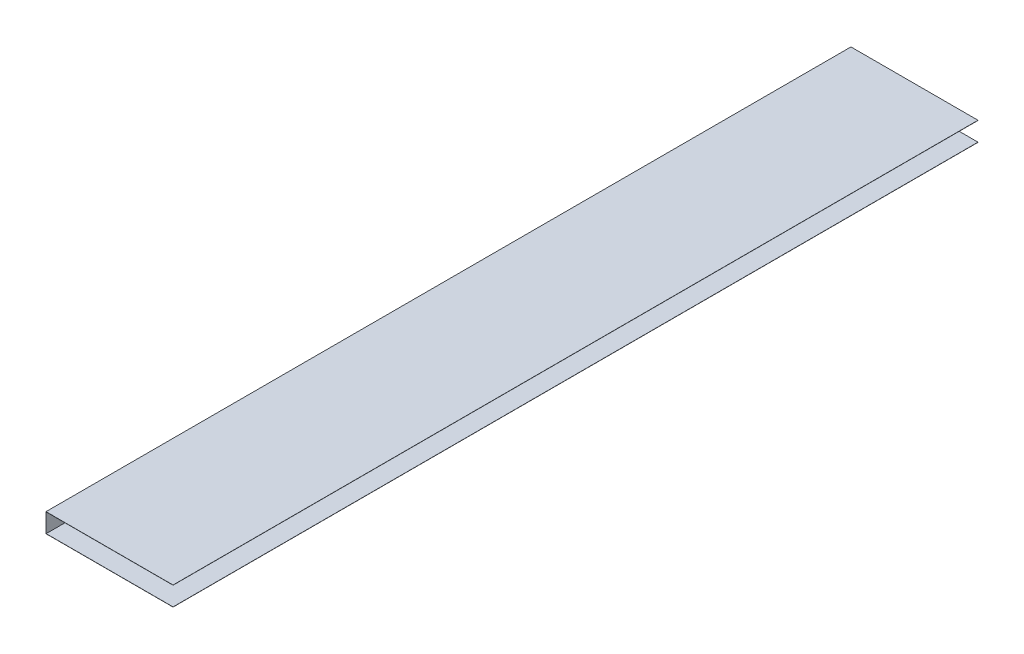
ISO-10303-21;
HEADER;
FILE_DESCRIPTION(('STEP AP214'),'2;1');
FILE_NAME('part.step','',(''),(''),'','','');
FILE_SCHEMA(('AUTOMOTIVE_DESIGN { 1 0 10303 214 1 1 1 1 }'));
ENDSEC;
DATA;
#1=APPLICATION_CONTEXT('core data for automotive mechanical design processes');
#2=APPLICATION_PROTOCOL_DEFINITION('international standard','automotive_design',2000,#1);
#3=PRODUCT_CONTEXT('',#1,'mechanical');
#4=PRODUCT('Part','Part','',(#3));
#5=PRODUCT_RELATED_PRODUCT_CATEGORY('part','',(#4));
#6=PRODUCT_DEFINITION_FORMATION('','',#4);
#7=PRODUCT_DEFINITION_CONTEXT('part definition',#1,'design');
#8=PRODUCT_DEFINITION('design','',#6,#7);
#9=PRODUCT_DEFINITION_SHAPE('','',#8);
#10=(LENGTH_UNIT() NAMED_UNIT(*) SI_UNIT(.MILLI.,.METRE.));
#11=(NAMED_UNIT(*) PLANE_ANGLE_UNIT() SI_UNIT($,.RADIAN.));
#12=(NAMED_UNIT(*) SI_UNIT($,.STERADIAN.) SOLID_ANGLE_UNIT());
#13=UNCERTAINTY_MEASURE_WITH_UNIT(LENGTH_MEASURE(1.E-05),#10,'distance_accuracy_value','');
#14=(GEOMETRIC_REPRESENTATION_CONTEXT(3) GLOBAL_UNCERTAINTY_ASSIGNED_CONTEXT((#13)) GLOBAL_UNIT_ASSIGNED_CONTEXT((#10,
#11,#12)) REPRESENTATION_CONTEXT('',''));
#15=CARTESIAN_POINT('',(0.,0.,0.));
#16=DIRECTION('',(0.,0.,1.));
#17=DIRECTION('',(1.,0.,0.));
#18=AXIS2_PLACEMENT_3D('',#15,#16,#17);
#19=CARTESIAN_POINT('',(0.,-22.,925.));
#20=DIRECTION('',(1.,0.,0.));
#21=DIRECTION('',(0.,0.,-1.));
#22=AXIS2_PLACEMENT_3D('',#19,#20,#21);
#23=PLANE('',#22);
#24=DIRECTION('',(0.,-1.,0.));
#25=VECTOR('',#24,1.);
#26=CARTESIAN_POINT('',(0.,-22.,0.));
#27=LINE('',#26,#25);
#28=CARTESIAN_POINT('',(0.,0.,0.));
#29=VERTEX_POINT('',#28);
#30=CARTESIAN_POINT('',(0.,-22.,0.));
#31=VERTEX_POINT('',#30);
#32=EDGE_CURVE('E133',#29,#31,#27,.T.);
#33=ORIENTED_EDGE('',*,*,#32,.T.);
#34=DIRECTION('',(0.,0.,-1.));
#35=VECTOR('',#34,1.);
#36=CARTESIAN_POINT('',(0.,-22.,925.));
#37=LINE('',#36,#35);
#38=CARTESIAN_POINT('',(0.,-22.,925.));
#39=VERTEX_POINT('',#38);
#40=EDGE_CURVE('E11',#39,#31,#37,.T.);
#41=ORIENTED_EDGE('',*,*,#40,.F.);
#42=DIRECTION('',(0.,-1.,0.));
#43=VECTOR('',#42,1.);
#44=CARTESIAN_POINT('',(0.,-22.,925.));
#45=LINE('',#44,#43);
#46=CARTESIAN_POINT('',(0.,0.,925.));
#47=VERTEX_POINT('',#46);
#48=EDGE_CURVE('E147',#47,#39,#45,.T.);
#49=ORIENTED_EDGE('',*,*,#48,.F.);
#50=DIRECTION('',(0.,0.,-1.));
#51=VECTOR('',#50,1.);
#52=CARTESIAN_POINT('',(0.,0.,925.));
#53=LINE('',#52,#51);
#54=EDGE_CURVE('E129',#47,#29,#53,.T.);
#55=ORIENTED_EDGE('',*,*,#54,.T.);
#56=EDGE_LOOP('',(#33,#41,#49,#55));
#57=FACE_BOUND('',#56,.T.);
#58=ADVANCED_FACE('F37',(#57),#23,.F.);
#59=CARTESIAN_POINT('',(146.,-22.,925.));
#60=DIRECTION('',(0.,1.,0.));
#61=DIRECTION('',(-1.,0.,0.));
#62=AXIS2_PLACEMENT_3D('',#59,#60,#61);
#63=PLANE('',#62);
#64=DIRECTION('',(1.,0.,0.));
#65=VECTOR('',#64,1.);
#66=CARTESIAN_POINT('',(146.,-22.,0.));
#67=LINE('',#66,#65);
#68=CARTESIAN_POINT('',(146.,-22.,0.));
#69=VERTEX_POINT('',#68);
#70=EDGE_CURVE('E136',#31,#69,#67,.T.);
#71=ORIENTED_EDGE('',*,*,#70,.T.);
#72=DIRECTION('',(0.,0.,-1.));
#73=VECTOR('',#72,1.);
#74=CARTESIAN_POINT('',(146.,-22.,925.));
#75=LINE('',#74,#73);
#76=CARTESIAN_POINT('',(146.,-22.,925.));
#77=VERTEX_POINT('',#76);
#78=EDGE_CURVE('E45',#77,#69,#75,.T.);
#79=ORIENTED_EDGE('',*,*,#78,.F.);
#80=DIRECTION('',(1.,0.,0.));
#81=VECTOR('',#80,1.);
#82=CARTESIAN_POINT('',(146.,-22.,925.));
#83=LINE('',#82,#81);
#84=EDGE_CURVE('E96',#39,#77,#83,.T.);
#85=ORIENTED_EDGE('',*,*,#84,.F.);
#86=ORIENTED_EDGE('',*,*,#40,.T.);
#87=EDGE_LOOP('',(#71,#79,#85,#86));
#88=FACE_BOUND('',#87,.T.);
#89=ADVANCED_FACE('F182',(#88),#63,.F.);
#90=CARTESIAN_POINT('',(146.,-21.8,925.));
#91=DIRECTION('',(-1.,0.,0.));
#92=DIRECTION('',(0.,0.,1.));
#93=AXIS2_PLACEMENT_3D('',#90,#91,#92);
#94=PLANE('',#93);
#95=DIRECTION('',(0.,1.,0.));
#96=VECTOR('',#95,1.);
#97=CARTESIAN_POINT('',(146.,-21.8,0.));
#98=LINE('',#97,#96);
#99=CARTESIAN_POINT('',(146.,-21.8,0.));
#100=VERTEX_POINT('',#99);
#101=EDGE_CURVE('E138',#69,#100,#98,.T.);
#102=ORIENTED_EDGE('',*,*,#101,.T.);
#103=DIRECTION('',(0.,0.,-1.));
#104=VECTOR('',#103,1.);
#105=CARTESIAN_POINT('',(146.,-21.8,925.));
#106=LINE('',#105,#104);
#107=CARTESIAN_POINT('',(146.,-21.8,925.));
#108=VERTEX_POINT('',#107);
#109=EDGE_CURVE('E154',#108,#100,#106,.T.);
#110=ORIENTED_EDGE('',*,*,#109,.F.);
#111=DIRECTION('',(0.,1.,0.));
#112=VECTOR('',#111,1.);
#113=CARTESIAN_POINT('',(146.,-21.8,925.));
#114=LINE('',#113,#112);
#115=EDGE_CURVE('E162',#77,#108,#114,.T.);
#116=ORIENTED_EDGE('',*,*,#115,.F.);
#117=ORIENTED_EDGE('',*,*,#78,.T.);
#118=EDGE_LOOP('',(#102,#110,#116,#117));
#119=FACE_BOUND('',#118,.T.);
#120=ADVANCED_FACE('F160',(#119),#94,.F.);
#121=CARTESIAN_POINT('',(0.2,-21.8,925.));
#122=DIRECTION('',(0.,-1.,0.));
#123=DIRECTION('',(0.,0.,-1.));
#124=AXIS2_PLACEMENT_3D('',#121,#122,#123);
#125=PLANE('',#124);
#126=DIRECTION('',(-1.,0.,0.));
#127=VECTOR('',#126,1.);
#128=CARTESIAN_POINT('',(0.2,-21.8,0.));
#129=LINE('',#128,#127);
#130=CARTESIAN_POINT('',(0.2,-21.8,0.));
#131=VERTEX_POINT('',#130);
#132=EDGE_CURVE('E140',#100,#131,#129,.T.);
#133=ORIENTED_EDGE('',*,*,#132,.T.);
#134=DIRECTION('',(0.,0.,-1.));
#135=VECTOR('',#134,1.);
#136=CARTESIAN_POINT('',(0.2,-21.8,925.));
#137=LINE('',#136,#135);
#138=CARTESIAN_POINT('',(0.2,-21.8,925.));
#139=VERTEX_POINT('',#138);
#140=EDGE_CURVE('E151',#139,#131,#137,.T.);
#141=ORIENTED_EDGE('',*,*,#140,.F.);
#142=DIRECTION('',(-1.,0.,0.));
#143=VECTOR('',#142,1.);
#144=CARTESIAN_POINT('',(0.2,-21.8,925.));
#145=LINE('',#144,#143);
#146=EDGE_CURVE('E174',#108,#139,#145,.T.);
#147=ORIENTED_EDGE('',*,*,#146,.F.);
#148=ORIENTED_EDGE('',*,*,#109,.T.);
#149=EDGE_LOOP('',(#133,#141,#147,#148));
#150=FACE_BOUND('',#149,.T.);
#151=ADVANCED_FACE('F170',(#150),#125,.F.);
#152=CARTESIAN_POINT('',(0.200000000000006,-0.200000000000018,925.));
#153=DIRECTION('',(-1.,0.,0.));
#154=DIRECTION('',(0.,-1.,0.));
#155=AXIS2_PLACEMENT_3D('',#152,#153,#154);
#156=PLANE('',#155);
#157=DIRECTION('',(0.,1.,0.));
#158=VECTOR('',#157,1.);
#159=CARTESIAN_POINT('',(0.200000000000006,-0.200000000000018,0.));
#160=LINE('',#159,#158);
#161=CARTESIAN_POINT('',(0.200000000000006,-0.200000000000018,0.));
#162=VERTEX_POINT('',#161);
#163=EDGE_CURVE('E142',#131,#162,#160,.T.);
#164=ORIENTED_EDGE('',*,*,#163,.T.);
#165=DIRECTION('',(0.,0.,-1.));
#166=VECTOR('',#165,1.);
#167=CARTESIAN_POINT('',(0.200000000000006,-0.200000000000018,925.));
#168=LINE('',#167,#166);
#169=CARTESIAN_POINT('',(0.200000000000006,-0.200000000000018,925.));
#170=VERTEX_POINT('',#169);
#171=EDGE_CURVE('E124',#170,#162,#168,.T.);
#172=ORIENTED_EDGE('',*,*,#171,.F.);
#173=DIRECTION('',(0.,1.,0.));
#174=VECTOR('',#173,1.);
#175=CARTESIAN_POINT('',(0.200000000000006,-0.200000000000018,925.));
#176=LINE('',#175,#174);
#177=EDGE_CURVE('E115',#139,#170,#176,.T.);
#178=ORIENTED_EDGE('',*,*,#177,.F.);
#179=ORIENTED_EDGE('',*,*,#140,.T.);
#180=EDGE_LOOP('',(#164,#172,#178,#179));
#181=FACE_BOUND('',#180,.T.);
#182=ADVANCED_FACE('F173',(#181),#156,.F.);
#183=CARTESIAN_POINT('',(146.,-0.199999999999999,925.));
#184=DIRECTION('',(0.,1.,0.));
#185=DIRECTION('',(-1.,0.,0.));
#186=AXIS2_PLACEMENT_3D('',#183,#184,#185);
#187=PLANE('',#186);
#188=DIRECTION('',(1.,0.,0.));
#189=VECTOR('',#188,1.);
#190=CARTESIAN_POINT('',(146.,-0.199999999999999,0.));
#191=LINE('',#190,#189);
#192=CARTESIAN_POINT('',(146.,-0.199999999999999,0.));
#193=VERTEX_POINT('',#192);
#194=EDGE_CURVE('E123',#162,#193,#191,.T.);
#195=ORIENTED_EDGE('',*,*,#194,.T.);
#196=DIRECTION('',(0.,0.,-1.));
#197=VECTOR('',#196,1.);
#198=CARTESIAN_POINT('',(146.,-0.199999999999999,925.));
#199=LINE('',#198,#197);
#200=CARTESIAN_POINT('',(146.,-0.199999999999999,925.));
#201=VERTEX_POINT('',#200);
#202=EDGE_CURVE('E120',#201,#193,#199,.T.);
#203=ORIENTED_EDGE('',*,*,#202,.F.);
#204=DIRECTION('',(1.,0.,0.));
#205=VECTOR('',#204,1.);
#206=CARTESIAN_POINT('',(146.,-0.199999999999999,925.));
#207=LINE('',#206,#205);
#208=EDGE_CURVE('E109',#170,#201,#207,.T.);
#209=ORIENTED_EDGE('',*,*,#208,.F.);
#210=ORIENTED_EDGE('',*,*,#171,.T.);
#211=EDGE_LOOP('',(#195,#203,#209,#210));
#212=FACE_BOUND('',#211,.T.);
#213=ADVANCED_FACE('F121',(#212),#187,.F.);
#214=CARTESIAN_POINT('',(146.,0.,925.));
#215=DIRECTION('',(-1.,0.,0.));
#216=DIRECTION('',(0.,0.,1.));
#217=AXIS2_PLACEMENT_3D('',#214,#215,#216);
#218=PLANE('',#217);
#219=DIRECTION('',(0.,1.,0.));
#220=VECTOR('',#219,1.);
#221=CARTESIAN_POINT('',(146.,0.,0.));
#222=LINE('',#221,#220);
#223=CARTESIAN_POINT('',(146.,0.,0.));
#224=VERTEX_POINT('',#223);
#225=EDGE_CURVE('E82',#193,#224,#222,.T.);
#226=ORIENTED_EDGE('',*,*,#225,.T.);
#227=DIRECTION('',(0.,0.,-1.));
#228=VECTOR('',#227,1.);
#229=CARTESIAN_POINT('',(146.,0.,925.));
#230=LINE('',#229,#228);
#231=CARTESIAN_POINT('',(146.,0.,925.));
#232=VERTEX_POINT('',#231);
#233=EDGE_CURVE('E125',#232,#224,#230,.T.);
#234=ORIENTED_EDGE('',*,*,#233,.F.);
#235=DIRECTION('',(0.,1.,0.));
#236=VECTOR('',#235,1.);
#237=CARTESIAN_POINT('',(146.,0.,925.));
#238=LINE('',#237,#236);
#239=EDGE_CURVE('E113',#201,#232,#238,.T.);
#240=ORIENTED_EDGE('',*,*,#239,.F.);
#241=ORIENTED_EDGE('',*,*,#202,.T.);
#242=EDGE_LOOP('',(#226,#234,#240,#241));
#243=FACE_BOUND('',#242,.T.);
#244=ADVANCED_FACE('F127',(#243),#218,.F.);
#245=CARTESIAN_POINT('',(0.,0.,925.));
#246=DIRECTION('',(0.,-1.,0.));
#247=DIRECTION('',(0.,0.,-1.));
#248=AXIS2_PLACEMENT_3D('',#245,#246,#247);
#249=PLANE('',#248);
#250=DIRECTION('',(-1.,0.,0.));
#251=VECTOR('',#250,1.);
#252=CARTESIAN_POINT('',(0.,0.,0.));
#253=LINE('',#252,#251);
#254=EDGE_CURVE('E88',#224,#29,#253,.T.);
#255=ORIENTED_EDGE('',*,*,#254,.T.);
#256=ORIENTED_EDGE('',*,*,#54,.F.);
#257=DIRECTION('',(-1.,0.,0.));
#258=VECTOR('',#257,1.);
#259=CARTESIAN_POINT('',(0.,0.,925.));
#260=LINE('',#259,#258);
#261=EDGE_CURVE('E53',#232,#47,#260,.T.);
#262=ORIENTED_EDGE('',*,*,#261,.F.);
#263=ORIENTED_EDGE('',*,*,#233,.T.);
#264=EDGE_LOOP('',(#255,#256,#262,#263));
#265=FACE_BOUND('',#264,.T.);
#266=ADVANCED_FACE('F198',(#265),#249,.F.);
#267=CARTESIAN_POINT('',(0.,0.,925.));
#268=DIRECTION('',(0.,0.,-1.));
#269=DIRECTION('',(-1.,0.,0.));
#270=AXIS2_PLACEMENT_3D('',#267,#268,#269);
#271=PLANE('',#270);
#272=ORIENTED_EDGE('',*,*,#48,.T.);
#273=ORIENTED_EDGE('',*,*,#84,.T.);
#274=ORIENTED_EDGE('',*,*,#115,.T.);
#275=ORIENTED_EDGE('',*,*,#146,.T.);
#276=ORIENTED_EDGE('',*,*,#177,.T.);
#277=ORIENTED_EDGE('',*,*,#208,.T.);
#278=ORIENTED_EDGE('',*,*,#239,.T.);
#279=ORIENTED_EDGE('',*,*,#261,.T.);
#280=EDGE_LOOP('',(#272,#273,#274,#275,#276,#277,#278,#279));
#281=FACE_BOUND('',#280,.T.);
#282=ADVANCED_FACE('F111',(#281),#271,.F.);
#283=CARTESIAN_POINT('',(0.,0.,0.));
#284=DIRECTION('',(0.,0.,-1.));
#285=DIRECTION('',(-1.,0.,0.));
#286=AXIS2_PLACEMENT_3D('',#283,#284,#285);
#287=PLANE('',#286);
#288=ORIENTED_EDGE('',*,*,#32,.F.);
#289=ORIENTED_EDGE('',*,*,#254,.F.);
#290=ORIENTED_EDGE('',*,*,#225,.F.);
#291=ORIENTED_EDGE('',*,*,#194,.F.);
#292=ORIENTED_EDGE('',*,*,#163,.F.);
#293=ORIENTED_EDGE('',*,*,#132,.F.);
#294=ORIENTED_EDGE('',*,*,#101,.F.);
#295=ORIENTED_EDGE('',*,*,#70,.F.);
#296=EDGE_LOOP('',(#288,#289,#290,#291,#292,#293,#294,#295));
#297=FACE_BOUND('',#296,.T.);
#298=ADVANCED_FACE('F166',(#297),#287,.T.);
#299=CLOSED_SHELL('',(#58,#89,#120,#151,#182,#213,#244,#266,#282,#298));
#300=MANIFOLD_SOLID_BREP('B2',#299);
#301=ADVANCED_BREP_SHAPE_REPRESENTATION('',(#18,#300),#14);
#302=SHAPE_DEFINITION_REPRESENTATION(#9,#301);
ENDSEC;
END-ISO-10303-21;
